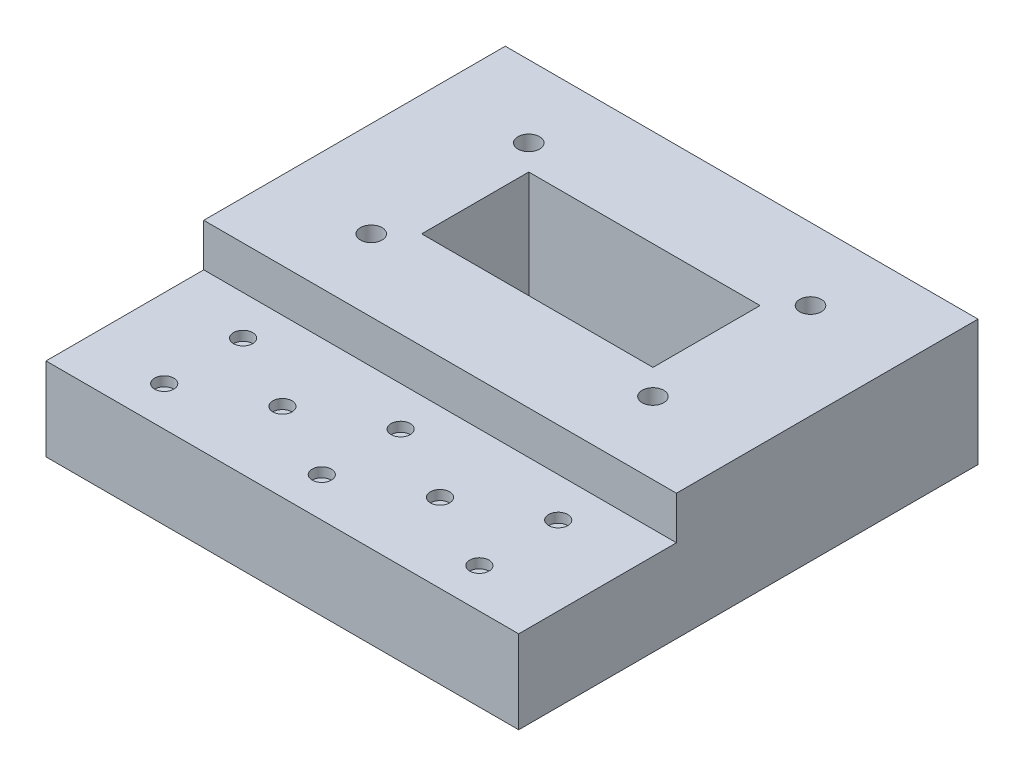
ISO-10303-21;
HEADER;
FILE_DESCRIPTION(('STEP AP214'),'2;1');
FILE_NAME('part.step','',(''),(''),'','','');
FILE_SCHEMA(('AUTOMOTIVE_DESIGN { 1 0 10303 214 1 1 1 1 }'));
ENDSEC;
DATA;
#1=APPLICATION_CONTEXT('core data for automotive mechanical design processes');
#2=APPLICATION_PROTOCOL_DEFINITION('international standard','automotive_design',2000,#1);
#3=PRODUCT_CONTEXT('',#1,'mechanical');
#4=PRODUCT('Part','Part','',(#3));
#5=PRODUCT_RELATED_PRODUCT_CATEGORY('part','',(#4));
#6=PRODUCT_DEFINITION_FORMATION('','',#4);
#7=PRODUCT_DEFINITION_CONTEXT('part definition',#1,'design');
#8=PRODUCT_DEFINITION('design','',#6,#7);
#9=PRODUCT_DEFINITION_SHAPE('','',#8);
#10=(LENGTH_UNIT() NAMED_UNIT(*) SI_UNIT(.MILLI.,.METRE.));
#11=(NAMED_UNIT(*) PLANE_ANGLE_UNIT() SI_UNIT($,.RADIAN.));
#12=(NAMED_UNIT(*) SI_UNIT($,.STERADIAN.) SOLID_ANGLE_UNIT());
#13=UNCERTAINTY_MEASURE_WITH_UNIT(LENGTH_MEASURE(1.E-05),#10,'distance_accuracy_value','');
#14=(GEOMETRIC_REPRESENTATION_CONTEXT(3) GLOBAL_UNCERTAINTY_ASSIGNED_CONTEXT((#13)) GLOBAL_UNIT_ASSIGNED_CONTEXT((#10,
#11,#12)) REPRESENTATION_CONTEXT('',''));
#15=CARTESIAN_POINT('',(0.,0.,0.));
#16=DIRECTION('',(0.,0.,1.));
#17=DIRECTION('',(1.,0.,0.));
#18=AXIS2_PLACEMENT_3D('',#15,#16,#17);
#19=CARTESIAN_POINT('',(0.,26.38,0.));
#20=DIRECTION('',(0.,1.,0.));
#21=DIRECTION('',(0.,0.,1.));
#22=AXIS2_PLACEMENT_3D('',#19,#20,#21);
#23=PLANE('',#22);
#24=CARTESIAN_POINT('',(-80.88,26.38,35.025));
#25=DIRECTION('',(0.,1.,0.));
#26=DIRECTION('',(0.,0.,1.));
#27=AXIS2_PLACEMENT_3D('',#24,#25,#26);
#28=CIRCLE('',#27,3.05);
#29=CARTESIAN_POINT('',(-80.88,26.38,38.075));
#30=VERTEX_POINT('',#29);
#31=EDGE_CURVE('E447',#30,#30,#28,.F.);
#32=ORIENTED_EDGE('',*,*,#31,.T.);
#33=EDGE_LOOP('',(#32));
#34=FACE_BOUND('',#33,.T.);
#35=CARTESIAN_POINT('',(-105.88,26.38,47.5375));
#36=DIRECTION('',(0.,1.,0.));
#37=DIRECTION('',(0.,0.,1.));
#38=AXIS2_PLACEMENT_3D('',#35,#36,#37);
#39=CIRCLE('',#38,3.04999999999999);
#40=CARTESIAN_POINT('',(-105.88,26.38,50.5875));
#41=VERTEX_POINT('',#40);
#42=EDGE_CURVE('E412',#41,#41,#39,.F.);
#43=ORIENTED_EDGE('',*,*,#42,.T.);
#44=EDGE_LOOP('',(#43));
#45=FACE_BOUND('',#44,.T.);
#46=CARTESIAN_POINT('',(-105.88,26.38,22.5125));
#47=DIRECTION('',(0.,1.,0.));
#48=DIRECTION('',(0.,0.,1.));
#49=AXIS2_PLACEMENT_3D('',#46,#47,#48);
#50=CIRCLE('',#49,3.05000000000001);
#51=CARTESIAN_POINT('',(-105.88,26.38,25.5625));
#52=VERTEX_POINT('',#51);
#53=EDGE_CURVE('E394',#52,#52,#50,.F.);
#54=ORIENTED_EDGE('',*,*,#53,.T.);
#55=EDGE_LOOP('',(#54));
#56=FACE_BOUND('',#55,.T.);
#57=DIRECTION('',(0.,0.,-1.));
#58=VECTOR('',#57,1.);
#59=CARTESIAN_POINT('',(-130.88,26.38,10.));
#60=LINE('',#59,#58);
#61=CARTESIAN_POINT('',(-130.88,26.38,60.05));
#62=VERTEX_POINT('',#61);
#63=CARTESIAN_POINT('',(-130.88,26.38,10.));
#64=VERTEX_POINT('',#63);
#65=EDGE_CURVE('E142',#62,#64,#60,.T.);
#66=ORIENTED_EDGE('',*,*,#65,.F.);
#67=DIRECTION('',(-1.,0.,0.));
#68=VECTOR('',#67,1.);
#69=CARTESIAN_POINT('',(-130.88,26.38,60.05));
#70=LINE('',#69,#68);
#71=CARTESIAN_POINT('',(19.12,26.38,60.05));
#72=VERTEX_POINT('',#71);
#73=EDGE_CURVE('E398',#72,#62,#70,.T.);
#74=ORIENTED_EDGE('',*,*,#73,.F.);
#75=DIRECTION('',(0.,0.,1.));
#76=VECTOR('',#75,1.);
#77=CARTESIAN_POINT('',(19.12,26.38,10.));
#78=LINE('',#77,#76);
#79=CARTESIAN_POINT('',(19.12,26.38,10.));
#80=VERTEX_POINT('',#79);
#81=EDGE_CURVE('E79',#80,#72,#78,.T.);
#82=ORIENTED_EDGE('',*,*,#81,.F.);
#83=DIRECTION('',(1.,0.,0.));
#84=VECTOR('',#83,1.);
#85=CARTESIAN_POINT('',(-130.88,26.38,10.));
#86=LINE('',#85,#84);
#87=EDGE_CURVE('E139',#64,#80,#86,.T.);
#88=ORIENTED_EDGE('',*,*,#87,.F.);
#89=EDGE_LOOP('',(#66,#74,#82,#88));
#90=FACE_BOUND('',#89,.T.);
#91=CARTESIAN_POINT('',(-55.88,26.38,22.5125));
#92=DIRECTION('',(0.,1.,0.));
#93=DIRECTION('',(0.,0.,1.));
#94=AXIS2_PLACEMENT_3D('',#91,#92,#93);
#95=CIRCLE('',#94,3.05);
#96=CARTESIAN_POINT('',(-55.88,26.38,25.5625));
#97=VERTEX_POINT('',#96);
#98=EDGE_CURVE('E441',#97,#97,#95,.T.);
#99=ORIENTED_EDGE('',*,*,#98,.F.);
#100=EDGE_LOOP('',(#99));
#101=FACE_BOUND('',#100,.T.);
#102=CARTESIAN_POINT('',(-55.88,26.38,47.5375));
#103=DIRECTION('',(0.,1.,0.));
#104=DIRECTION('',(0.,0.,1.));
#105=AXIS2_PLACEMENT_3D('',#102,#103,#104);
#106=CIRCLE('',#105,3.05);
#107=CARTESIAN_POINT('',(-55.88,26.38,50.5875));
#108=VERTEX_POINT('',#107);
#109=EDGE_CURVE('E435',#108,#108,#106,.T.);
#110=ORIENTED_EDGE('',*,*,#109,.F.);
#111=EDGE_LOOP('',(#110));
#112=FACE_BOUND('',#111,.T.);
#113=CARTESIAN_POINT('',(-30.88,26.38,35.025));
#114=DIRECTION('',(0.,1.,0.));
#115=DIRECTION('',(0.,0.,1.));
#116=AXIS2_PLACEMENT_3D('',#113,#114,#115);
#117=CIRCLE('',#116,3.05);
#118=CARTESIAN_POINT('',(-30.88,26.38,38.075));
#119=VERTEX_POINT('',#118);
#120=EDGE_CURVE('E429',#119,#119,#117,.T.);
#121=ORIENTED_EDGE('',*,*,#120,.F.);
#122=EDGE_LOOP('',(#121));
#123=FACE_BOUND('',#122,.T.);
#124=CARTESIAN_POINT('',(-5.88,26.38,22.5125));
#125=DIRECTION('',(0.,1.,0.));
#126=DIRECTION('',(0.,0.,1.));
#127=AXIS2_PLACEMENT_3D('',#124,#125,#126);
#128=CIRCLE('',#127,3.05);
#129=CARTESIAN_POINT('',(-5.88,26.38,25.5625));
#130=VERTEX_POINT('',#129);
#131=EDGE_CURVE('E423',#130,#130,#128,.T.);
#132=ORIENTED_EDGE('',*,*,#131,.F.);
#133=EDGE_LOOP('',(#132));
#134=FACE_BOUND('',#133,.T.);
#135=CARTESIAN_POINT('',(-5.88,26.38,47.5375));
#136=DIRECTION('',(0.,1.,0.));
#137=DIRECTION('',(0.,0.,1.));
#138=AXIS2_PLACEMENT_3D('',#135,#136,#137);
#139=CIRCLE('',#138,3.05);
#140=CARTESIAN_POINT('',(-5.88,26.38,50.5875));
#141=VERTEX_POINT('',#140);
#142=EDGE_CURVE('E417',#141,#141,#139,.T.);
#143=ORIENTED_EDGE('',*,*,#142,.F.);
#144=EDGE_LOOP('',(#143));
#145=FACE_BOUND('',#144,.T.);
#146=ADVANCED_FACE('F62',(#34,#45,#56,#90,#101,#112,#123,#134,#145),#23,.T.);
#147=CARTESIAN_POINT('',(-100.58,40.,-12.85));
#148=DIRECTION('',(0.,-1.,0.));
#149=DIRECTION('',(0.,0.,-1.));
#150=AXIS2_PLACEMENT_3D('',#147,#148,#149);
#151=CYLINDRICAL_SURFACE('',#150,3.43);
#152=CARTESIAN_POINT('',(-100.58,40.,-12.85));
#153=DIRECTION('',(0.,1.,0.));
#154=DIRECTION('',(0.,0.,1.));
#155=AXIS2_PLACEMENT_3D('',#152,#153,#154);
#156=CIRCLE('',#155,3.43);
#157=CARTESIAN_POINT('',(-100.58,40.,-9.41999999999997));
#158=VERTEX_POINT('',#157);
#159=EDGE_CURVE('E203',#158,#158,#156,.T.);
#160=ORIENTED_EDGE('',*,*,#159,.T.);
#161=EDGE_LOOP('',(#160));
#162=FACE_BOUND('',#161,.T.);
#163=CARTESIAN_POINT('',(-100.58,8.,-12.85));
#164=DIRECTION('',(0.,-1.,0.));
#165=DIRECTION('',(0.,0.,-1.));
#166=AXIS2_PLACEMENT_3D('',#163,#164,#165);
#167=CIRCLE('',#166,3.43);
#168=CARTESIAN_POINT('',(-100.58,8.,-16.28));
#169=VERTEX_POINT('',#168);
#170=EDGE_CURVE('E66',#169,#169,#167,.T.);
#171=ORIENTED_EDGE('',*,*,#170,.T.);
#172=EDGE_LOOP('',(#171));
#173=FACE_BOUND('',#172,.T.);
#174=ADVANCED_FACE('F249',(#162,#173),#151,.F.);
#175=CARTESIAN_POINT('',(-100.58,40.,-62.84));
#176=DIRECTION('',(0.,-1.,0.));
#177=DIRECTION('',(0.,0.,-1.));
#178=AXIS2_PLACEMENT_3D('',#175,#176,#177);
#179=CYLINDRICAL_SURFACE('',#178,3.43);
#180=CARTESIAN_POINT('',(-100.58,40.,-62.84));
#181=DIRECTION('',(0.,1.,0.));
#182=DIRECTION('',(0.,0.,1.));
#183=AXIS2_PLACEMENT_3D('',#180,#181,#182);
#184=CIRCLE('',#183,3.43);
#185=CARTESIAN_POINT('',(-100.58,40.,-59.41));
#186=VERTEX_POINT('',#185);
#187=EDGE_CURVE('E200',#186,#186,#184,.T.);
#188=ORIENTED_EDGE('',*,*,#187,.T.);
#189=EDGE_LOOP('',(#188));
#190=FACE_BOUND('',#189,.T.);
#191=CARTESIAN_POINT('',(-100.58,8.,-62.84));
#192=DIRECTION('',(0.,-1.,0.));
#193=DIRECTION('',(0.,0.,-1.));
#194=AXIS2_PLACEMENT_3D('',#191,#192,#193);
#195=CIRCLE('',#194,3.43);
#196=CARTESIAN_POINT('',(-100.58,8.,-66.27));
#197=VERTEX_POINT('',#196);
#198=EDGE_CURVE('E242',#197,#197,#195,.T.);
#199=ORIENTED_EDGE('',*,*,#198,.T.);
#200=EDGE_LOOP('',(#199));
#201=FACE_BOUND('',#200,.T.);
#202=ADVANCED_FACE('F307',(#190,#201),#179,.F.);
#203=CARTESIAN_POINT('',(-11.1800000000001,40.,-62.84));
#204=DIRECTION('',(0.,-1.,0.));
#205=DIRECTION('',(0.,0.,-1.));
#206=AXIS2_PLACEMENT_3D('',#203,#204,#205);
#207=CYLINDRICAL_SURFACE('',#206,3.43);
#208=CARTESIAN_POINT('',(-11.1800000000001,40.,-62.84));
#209=DIRECTION('',(0.,1.,0.));
#210=DIRECTION('',(0.,0.,1.));
#211=AXIS2_PLACEMENT_3D('',#208,#209,#210);
#212=CIRCLE('',#211,3.43);
#213=CARTESIAN_POINT('',(-11.1800000000001,40.,-59.41));
#214=VERTEX_POINT('',#213);
#215=EDGE_CURVE('E197',#214,#214,#212,.T.);
#216=ORIENTED_EDGE('',*,*,#215,.T.);
#217=EDGE_LOOP('',(#216));
#218=FACE_BOUND('',#217,.T.);
#219=CARTESIAN_POINT('',(-11.1800000000001,8.,-62.84));
#220=DIRECTION('',(0.,-1.,0.));
#221=DIRECTION('',(0.,0.,-1.));
#222=AXIS2_PLACEMENT_3D('',#219,#220,#221);
#223=CIRCLE('',#222,3.43);
#224=CARTESIAN_POINT('',(-11.1800000000001,8.,-66.27));
#225=VERTEX_POINT('',#224);
#226=EDGE_CURVE('E240',#225,#225,#223,.T.);
#227=ORIENTED_EDGE('',*,*,#226,.T.);
#228=EDGE_LOOP('',(#227));
#229=FACE_BOUND('',#228,.T.);
#230=ADVANCED_FACE('F351',(#218,#229),#207,.F.);
#231=CARTESIAN_POINT('',(-11.18,40.,-12.85));
#232=DIRECTION('',(0.,-1.,0.));
#233=DIRECTION('',(0.,0.,-1.));
#234=AXIS2_PLACEMENT_3D('',#231,#232,#233);
#235=CYLINDRICAL_SURFACE('',#234,3.43);
#236=CARTESIAN_POINT('',(-11.18,40.,-12.85));
#237=DIRECTION('',(0.,1.,0.));
#238=DIRECTION('',(0.,0.,1.));
#239=AXIS2_PLACEMENT_3D('',#236,#237,#238);
#240=CIRCLE('',#239,3.43);
#241=CARTESIAN_POINT('',(-11.18,40.,-9.41999999999998));
#242=VERTEX_POINT('',#241);
#243=EDGE_CURVE('E194',#242,#242,#240,.T.);
#244=ORIENTED_EDGE('',*,*,#243,.T.);
#245=EDGE_LOOP('',(#244));
#246=FACE_BOUND('',#245,.T.);
#247=CARTESIAN_POINT('',(-11.18,8.,-12.85));
#248=DIRECTION('',(0.,-1.,0.));
#249=DIRECTION('',(0.,0.,-1.));
#250=AXIS2_PLACEMENT_3D('',#247,#248,#249);
#251=CIRCLE('',#250,3.43);
#252=CARTESIAN_POINT('',(-11.18,8.,-16.28));
#253=VERTEX_POINT('',#252);
#254=EDGE_CURVE('E191',#253,#253,#251,.T.);
#255=ORIENTED_EDGE('',*,*,#254,.T.);
#256=EDGE_LOOP('',(#255));
#257=FACE_BOUND('',#256,.T.);
#258=ADVANCED_FACE('F348',(#246,#257),#235,.F.);
#259=CARTESIAN_POINT('',(0.,40.,0.));
#260=DIRECTION('',(0.,1.,0.));
#261=DIRECTION('',(0.,0.,1.));
#262=AXIS2_PLACEMENT_3D('',#259,#260,#261);
#263=PLANE('',#262);
#264=ORIENTED_EDGE('',*,*,#215,.F.);
#265=EDGE_LOOP('',(#264));
#266=FACE_BOUND('',#265,.T.);
#267=ORIENTED_EDGE('',*,*,#159,.F.);
#268=EDGE_LOOP('',(#267));
#269=FACE_BOUND('',#268,.T.);
#270=DIRECTION('',(-1.,0.,0.));
#271=VECTOR('',#270,1.);
#272=CARTESIAN_POINT('',(-121.76,40.,-85.69));
#273=LINE('',#272,#271);
#274=CARTESIAN_POINT('',(19.12,40.,-85.69));
#275=VERTEX_POINT('',#274);
#276=CARTESIAN_POINT('',(-130.88,40.,-85.69));
#277=VERTEX_POINT('',#276);
#278=EDGE_CURVE('E12',#275,#277,#273,.T.);
#279=ORIENTED_EDGE('',*,*,#278,.T.);
#280=DIRECTION('',(0.,0.,1.));
#281=VECTOR('',#280,1.);
#282=CARTESIAN_POINT('',(-130.88,40.,0.));
#283=LINE('',#282,#281);
#284=CARTESIAN_POINT('',(-130.88,40.,10.));
#285=VERTEX_POINT('',#284);
#286=EDGE_CURVE('E159',#277,#285,#283,.T.);
#287=ORIENTED_EDGE('',*,*,#286,.T.);
#288=DIRECTION('',(1.,0.,0.));
#289=VECTOR('',#288,1.);
#290=CARTESIAN_POINT('',(-121.76,40.,10.));
#291=LINE('',#290,#289);
#292=CARTESIAN_POINT('',(19.12,40.,10.));
#293=VERTEX_POINT('',#292);
#294=EDGE_CURVE('E71',#285,#293,#291,.T.);
#295=ORIENTED_EDGE('',*,*,#294,.T.);
#296=DIRECTION('',(0.,0.,-1.));
#297=VECTOR('',#296,1.);
#298=CARTESIAN_POINT('',(19.12,40.,0.));
#299=LINE('',#298,#297);
#300=EDGE_CURVE('E169',#293,#275,#299,.T.);
#301=ORIENTED_EDGE('',*,*,#300,.T.);
#302=EDGE_LOOP('',(#279,#287,#295,#301));
#303=FACE_BOUND('',#302,.T.);
#304=DIRECTION('',(1.,0.,0.));
#305=VECTOR('',#304,1.);
#306=CARTESIAN_POINT('',(-92.58,40.,-20.85));
#307=LINE('',#306,#305);
#308=CARTESIAN_POINT('',(-92.58,40.,-20.85));
#309=VERTEX_POINT('',#308);
#310=CARTESIAN_POINT('',(-19.18,40.,-20.85));
#311=VERTEX_POINT('',#310);
#312=EDGE_CURVE('E209',#309,#311,#307,.T.);
#313=ORIENTED_EDGE('',*,*,#312,.F.);
#314=DIRECTION('',(0.,0.,1.));
#315=VECTOR('',#314,1.);
#316=CARTESIAN_POINT('',(-92.58,40.,-20.85));
#317=LINE('',#316,#315);
#318=CARTESIAN_POINT('',(-92.58,40.,-54.84));
#319=VERTEX_POINT('',#318);
#320=EDGE_CURVE('E207',#319,#309,#317,.T.);
#321=ORIENTED_EDGE('',*,*,#320,.F.);
#322=DIRECTION('',(-1.,0.,0.));
#323=VECTOR('',#322,1.);
#324=CARTESIAN_POINT('',(-92.58,40.,-54.84));
#325=LINE('',#324,#323);
#326=CARTESIAN_POINT('',(-19.18,40.,-54.84));
#327=VERTEX_POINT('',#326);
#328=EDGE_CURVE('E214',#327,#319,#325,.T.);
#329=ORIENTED_EDGE('',*,*,#328,.F.);
#330=DIRECTION('',(0.,0.,-1.));
#331=VECTOR('',#330,1.);
#332=CARTESIAN_POINT('',(-19.18,40.,-20.85));
#333=LINE('',#332,#331);
#334=EDGE_CURVE('E212',#311,#327,#333,.T.);
#335=ORIENTED_EDGE('',*,*,#334,.F.);
#336=EDGE_LOOP('',(#313,#321,#329,#335));
#337=FACE_BOUND('',#336,.T.);
#338=ORIENTED_EDGE('',*,*,#187,.F.);
#339=EDGE_LOOP('',(#338));
#340=FACE_BOUND('',#339,.T.);
#341=ORIENTED_EDGE('',*,*,#243,.F.);
#342=EDGE_LOOP('',(#341));
#343=FACE_BOUND('',#342,.T.);
#344=ADVANCED_FACE('F267',(#266,#269,#303,#337,#340,#343),#263,.T.);
#345=CARTESIAN_POINT('',(0.,0.,0.));
#346=DIRECTION('',(0.,1.,0.));
#347=DIRECTION('',(0.,0.,1.));
#348=AXIS2_PLACEMENT_3D('',#345,#346,#347);
#349=PLANE('',#348);
#350=CARTESIAN_POINT('',(-100.58,0.,-62.84));
#351=DIRECTION('',(0.,-1.,0.));
#352=DIRECTION('',(0.,0.,-1.));
#353=AXIS2_PLACEMENT_3D('',#350,#351,#352);
#354=CIRCLE('',#353,8.00000000000006);
#355=CARTESIAN_POINT('',(-100.58,0.,-70.8400000000001));
#356=VERTEX_POINT('',#355);
#357=EDGE_CURVE('E162',#356,#356,#354,.T.);
#358=ORIENTED_EDGE('',*,*,#357,.F.);
#359=EDGE_LOOP('',(#358));
#360=FACE_BOUND('',#359,.T.);
#361=CARTESIAN_POINT('',(-11.1800000000001,0.,-62.84));
#362=DIRECTION('',(0.,-1.,0.));
#363=DIRECTION('',(0.,0.,-1.));
#364=AXIS2_PLACEMENT_3D('',#361,#362,#363);
#365=CIRCLE('',#364,7.99999999999995);
#366=CARTESIAN_POINT('',(-11.1800000000001,0.,-70.84));
#367=VERTEX_POINT('',#366);
#368=EDGE_CURVE('E180',#367,#367,#365,.T.);
#369=ORIENTED_EDGE('',*,*,#368,.F.);
#370=EDGE_LOOP('',(#369));
#371=FACE_BOUND('',#370,.T.);
#372=CARTESIAN_POINT('',(-11.18,0.,-12.85));
#373=DIRECTION('',(0.,-1.,0.));
#374=DIRECTION('',(0.,0.,-1.));
#375=AXIS2_PLACEMENT_3D('',#372,#373,#374);
#376=CIRCLE('',#375,8.00000000000002);
#377=CARTESIAN_POINT('',(-11.18,0.,-20.85));
#378=VERTEX_POINT('',#377);
#379=EDGE_CURVE('E174',#378,#378,#376,.T.);
#380=ORIENTED_EDGE('',*,*,#379,.F.);
#381=EDGE_LOOP('',(#380));
#382=FACE_BOUND('',#381,.T.);
#383=CARTESIAN_POINT('',(-100.58,0.,-12.85));
#384=DIRECTION('',(0.,-1.,0.));
#385=DIRECTION('',(0.,0.,-1.));
#386=AXIS2_PLACEMENT_3D('',#383,#384,#385);
#387=CIRCLE('',#386,8.00000000000001);
#388=CARTESIAN_POINT('',(-100.58,0.,-20.85));
#389=VERTEX_POINT('',#388);
#390=EDGE_CURVE('E173',#389,#389,#387,.T.);
#391=ORIENTED_EDGE('',*,*,#390,.F.);
#392=EDGE_LOOP('',(#391));
#393=FACE_BOUND('',#392,.T.);
#394=DIRECTION('',(0.,0.,-1.));
#395=VECTOR('',#394,1.);
#396=CARTESIAN_POINT('',(19.12,0.,0.));
#397=LINE('',#396,#395);
#398=CARTESIAN_POINT('',(19.12,0.,60.05));
#399=VERTEX_POINT('',#398);
#400=CARTESIAN_POINT('',(19.12,0.,-85.69));
#401=VERTEX_POINT('',#400);
#402=EDGE_CURVE('E273',#399,#401,#397,.T.);
#403=ORIENTED_EDGE('',*,*,#402,.F.);
#404=DIRECTION('',(-1.,0.,0.));
#405=VECTOR('',#404,1.);
#406=CARTESIAN_POINT('',(-130.88,0.,60.05));
#407=LINE('',#406,#405);
#408=CARTESIAN_POINT('',(-130.88,0.,60.05));
#409=VERTEX_POINT('',#408);
#410=EDGE_CURVE('E157',#399,#409,#407,.T.);
#411=ORIENTED_EDGE('',*,*,#410,.T.);
#412=DIRECTION('',(0.,0.,1.));
#413=VECTOR('',#412,1.);
#414=CARTESIAN_POINT('',(-130.88,0.,0.));
#415=LINE('',#414,#413);
#416=CARTESIAN_POINT('',(-130.88,0.,-85.69));
#417=VERTEX_POINT('',#416);
#418=EDGE_CURVE('E160',#417,#409,#415,.T.);
#419=ORIENTED_EDGE('',*,*,#418,.F.);
#420=DIRECTION('',(-1.,0.,0.));
#421=VECTOR('',#420,1.);
#422=CARTESIAN_POINT('',(-121.76,0.,-85.69));
#423=LINE('',#422,#421);
#424=EDGE_CURVE('E235',#401,#417,#423,.T.);
#425=ORIENTED_EDGE('',*,*,#424,.F.);
#426=EDGE_LOOP('',(#403,#411,#419,#425));
#427=FACE_BOUND('',#426,.T.);
#428=DIRECTION('',(0.,0.,1.));
#429=VECTOR('',#428,1.);
#430=CARTESIAN_POINT('',(-92.58,0.,-20.85));
#431=LINE('',#430,#429);
#432=CARTESIAN_POINT('',(-92.58,0.,-54.84));
#433=VERTEX_POINT('',#432);
#434=CARTESIAN_POINT('',(-92.58,0.,-20.85));
#435=VERTEX_POINT('',#434);
#436=EDGE_CURVE('E206',#433,#435,#431,.T.);
#437=ORIENTED_EDGE('',*,*,#436,.T.);
#438=DIRECTION('',(1.,0.,0.));
#439=VECTOR('',#438,1.);
#440=CARTESIAN_POINT('',(-92.58,0.,-20.85));
#441=LINE('',#440,#439);
#442=CARTESIAN_POINT('',(-19.18,0.,-20.85));
#443=VERTEX_POINT('',#442);
#444=EDGE_CURVE('E219',#435,#443,#441,.T.);
#445=ORIENTED_EDGE('',*,*,#444,.T.);
#446=DIRECTION('',(0.,0.,-1.));
#447=VECTOR('',#446,1.);
#448=CARTESIAN_POINT('',(-19.18,0.,-20.85));
#449=LINE('',#448,#447);
#450=CARTESIAN_POINT('',(-19.18,0.,-54.84));
#451=VERTEX_POINT('',#450);
#452=EDGE_CURVE('E222',#443,#451,#449,.T.);
#453=ORIENTED_EDGE('',*,*,#452,.T.);
#454=DIRECTION('',(-1.,0.,0.));
#455=VECTOR('',#454,1.);
#456=CARTESIAN_POINT('',(-92.58,0.,-54.84));
#457=LINE('',#456,#455);
#458=EDGE_CURVE('E210',#451,#433,#457,.T.);
#459=ORIENTED_EDGE('',*,*,#458,.T.);
#460=EDGE_LOOP('',(#437,#445,#453,#459));
#461=FACE_BOUND('',#460,.T.);
#462=ADVANCED_FACE('F264',(#360,#371,#382,#393,#427,#461),#349,.F.);
#463=CARTESIAN_POINT('',(-121.76,40.,10.));
#464=DIRECTION('',(0.,0.,-1.));
#465=DIRECTION('',(-1.,0.,0.));
#466=AXIS2_PLACEMENT_3D('',#463,#464,#465);
#467=PLANE('',#466);
#468=DIRECTION('',(0.,-1.,0.));
#469=VECTOR('',#468,1.);
#470=CARTESIAN_POINT('',(-130.88,136.123620926388,10.));
#471=LINE('',#470,#469);
#472=EDGE_CURVE('E153',#285,#64,#471,.T.);
#473=ORIENTED_EDGE('',*,*,#472,.T.);
#474=ORIENTED_EDGE('',*,*,#87,.T.);
#475=DIRECTION('',(0.,-1.,0.));
#476=VECTOR('',#475,1.);
#477=CARTESIAN_POINT('',(19.12,136.123620926388,10.));
#478=LINE('',#477,#476);
#479=EDGE_CURVE('E404',#293,#80,#478,.T.);
#480=ORIENTED_EDGE('',*,*,#479,.F.);
#481=ORIENTED_EDGE('',*,*,#294,.F.);
#482=EDGE_LOOP('',(#473,#474,#480,#481));
#483=FACE_BOUND('',#482,.T.);
#484=ADVANCED_FACE('F64',(#483),#467,.F.);
#485=CARTESIAN_POINT('',(-121.76,40.,-85.69));
#486=DIRECTION('',(0.,0.,1.));
#487=DIRECTION('',(1.,0.,0.));
#488=AXIS2_PLACEMENT_3D('',#485,#486,#487);
#489=PLANE('',#488);
#490=ORIENTED_EDGE('',*,*,#424,.T.);
#491=DIRECTION('',(0.,-1.,0.));
#492=VECTOR('',#491,1.);
#493=CARTESIAN_POINT('',(-130.88,136.123620926388,-85.69));
#494=LINE('',#493,#492);
#495=EDGE_CURVE('E164',#277,#417,#494,.T.);
#496=ORIENTED_EDGE('',*,*,#495,.F.);
#497=ORIENTED_EDGE('',*,*,#278,.F.);
#498=DIRECTION('',(0.,-1.,0.));
#499=VECTOR('',#498,1.);
#500=CARTESIAN_POINT('',(19.12,136.123620926388,-85.69));
#501=LINE('',#500,#499);
#502=EDGE_CURVE('E388',#275,#401,#501,.T.);
#503=ORIENTED_EDGE('',*,*,#502,.T.);
#504=EDGE_LOOP('',(#490,#496,#497,#503));
#505=FACE_BOUND('',#504,.T.);
#506=ADVANCED_FACE('F378',(#505),#489,.F.);
#507=CARTESIAN_POINT('',(-92.58,40.,-20.85));
#508=DIRECTION('',(1.,0.,0.));
#509=DIRECTION('',(0.,0.,-1.));
#510=AXIS2_PLACEMENT_3D('',#507,#508,#509);
#511=PLANE('',#510);
#512=ORIENTED_EDGE('',*,*,#436,.F.);
#513=DIRECTION('',(0.,-1.,0.));
#514=VECTOR('',#513,1.);
#515=CARTESIAN_POINT('',(-92.58,40.,-54.84));
#516=LINE('',#515,#514);
#517=EDGE_CURVE('E216',#319,#433,#516,.T.);
#518=ORIENTED_EDGE('',*,*,#517,.F.);
#519=ORIENTED_EDGE('',*,*,#320,.T.);
#520=DIRECTION('',(0.,-1.,0.));
#521=VECTOR('',#520,1.);
#522=CARTESIAN_POINT('',(-92.58,40.,-20.85));
#523=LINE('',#522,#521);
#524=EDGE_CURVE('E232',#309,#435,#523,.T.);
#525=ORIENTED_EDGE('',*,*,#524,.T.);
#526=EDGE_LOOP('',(#512,#518,#519,#525));
#527=FACE_BOUND('',#526,.T.);
#528=ADVANCED_FACE('F277',(#527),#511,.T.);
#529=CARTESIAN_POINT('',(-92.58,40.,-20.85));
#530=DIRECTION('',(0.,0.,-1.));
#531=DIRECTION('',(-1.,0.,0.));
#532=AXIS2_PLACEMENT_3D('',#529,#530,#531);
#533=PLANE('',#532);
#534=ORIENTED_EDGE('',*,*,#444,.F.);
#535=ORIENTED_EDGE('',*,*,#524,.F.);
#536=ORIENTED_EDGE('',*,*,#312,.T.);
#537=DIRECTION('',(0.,-1.,0.));
#538=VECTOR('',#537,1.);
#539=CARTESIAN_POINT('',(-19.18,40.,-20.85));
#540=LINE('',#539,#538);
#541=EDGE_CURVE('E230',#311,#443,#540,.T.);
#542=ORIENTED_EDGE('',*,*,#541,.T.);
#543=EDGE_LOOP('',(#534,#535,#536,#542));
#544=FACE_BOUND('',#543,.T.);
#545=ADVANCED_FACE('F287',(#544),#533,.T.);
#546=CARTESIAN_POINT('',(-19.18,40.,-20.85));
#547=DIRECTION('',(-1.,0.,0.));
#548=DIRECTION('',(0.,0.,1.));
#549=AXIS2_PLACEMENT_3D('',#546,#547,#548);
#550=PLANE('',#549);
#551=ORIENTED_EDGE('',*,*,#452,.F.);
#552=ORIENTED_EDGE('',*,*,#541,.F.);
#553=ORIENTED_EDGE('',*,*,#334,.T.);
#554=DIRECTION('',(0.,-1.,0.));
#555=VECTOR('',#554,1.);
#556=CARTESIAN_POINT('',(-19.18,40.,-54.84));
#557=LINE('',#556,#555);
#558=EDGE_CURVE('E87',#327,#451,#557,.T.);
#559=ORIENTED_EDGE('',*,*,#558,.T.);
#560=EDGE_LOOP('',(#551,#552,#553,#559));
#561=FACE_BOUND('',#560,.T.);
#562=ADVANCED_FACE('F291',(#561),#550,.T.);
#563=CARTESIAN_POINT('',(-92.58,40.,-54.84));
#564=DIRECTION('',(0.,0.,1.));
#565=DIRECTION('',(1.,0.,0.));
#566=AXIS2_PLACEMENT_3D('',#563,#564,#565);
#567=PLANE('',#566);
#568=ORIENTED_EDGE('',*,*,#458,.F.);
#569=ORIENTED_EDGE('',*,*,#558,.F.);
#570=ORIENTED_EDGE('',*,*,#328,.T.);
#571=ORIENTED_EDGE('',*,*,#517,.T.);
#572=EDGE_LOOP('',(#568,#569,#570,#571));
#573=FACE_BOUND('',#572,.T.);
#574=ADVANCED_FACE('F280',(#573),#567,.T.);
#575=CARTESIAN_POINT('',(-11.18,8.,-12.85));
#576=DIRECTION('',(0.,-1.,0.));
#577=DIRECTION('',(0.,0.,-1.));
#578=AXIS2_PLACEMENT_3D('',#575,#576,#577);
#579=CYLINDRICAL_SURFACE('',#578,8.00000000000002);
#580=CARTESIAN_POINT('',(-11.18,8.,-12.85));
#581=DIRECTION('',(0.,-1.,0.));
#582=DIRECTION('',(0.,0.,-1.));
#583=AXIS2_PLACEMENT_3D('',#580,#581,#582);
#584=CIRCLE('',#583,8.00000000000002);
#585=CARTESIAN_POINT('',(-11.18,8.,-20.85));
#586=VERTEX_POINT('',#585);
#587=EDGE_CURVE('E170',#586,#586,#584,.T.);
#588=ORIENTED_EDGE('',*,*,#587,.F.);
#589=EDGE_LOOP('',(#588));
#590=FACE_BOUND('',#589,.T.);
#591=ORIENTED_EDGE('',*,*,#379,.T.);
#592=EDGE_LOOP('',(#591));
#593=FACE_BOUND('',#592,.T.);
#594=ADVANCED_FACE('F298',(#590,#593),#579,.F.);
#595=CARTESIAN_POINT('',(-11.18,8.,-12.85));
#596=DIRECTION('',(0.,-1.,0.));
#597=DIRECTION('',(0.,0.,-1.));
#598=AXIS2_PLACEMENT_3D('',#595,#596,#597);
#599=PLANE('',#598);
#600=ORIENTED_EDGE('',*,*,#254,.F.);
#601=EDGE_LOOP('',(#600));
#602=FACE_BOUND('',#601,.T.);
#603=ORIENTED_EDGE('',*,*,#587,.T.);
#604=EDGE_LOOP('',(#603));
#605=FACE_BOUND('',#604,.T.);
#606=ADVANCED_FACE('F326',(#602,#605),#599,.T.);
#607=CARTESIAN_POINT('',(-11.1800000000001,8.,-62.84));
#608=DIRECTION('',(0.,-1.,0.));
#609=DIRECTION('',(0.,0.,-1.));
#610=AXIS2_PLACEMENT_3D('',#607,#608,#609);
#611=CYLINDRICAL_SURFACE('',#610,7.99999999999995);
#612=CARTESIAN_POINT('',(-11.1800000000001,8.,-62.84));
#613=DIRECTION('',(0.,-1.,0.));
#614=DIRECTION('',(0.,0.,-1.));
#615=AXIS2_PLACEMENT_3D('',#612,#613,#614);
#616=CIRCLE('',#615,7.99999999999995);
#617=CARTESIAN_POINT('',(-11.1800000000001,8.,-70.84));
#618=VERTEX_POINT('',#617);
#619=EDGE_CURVE('E177',#618,#618,#616,.T.);
#620=ORIENTED_EDGE('',*,*,#619,.F.);
#621=EDGE_LOOP('',(#620));
#622=FACE_BOUND('',#621,.T.);
#623=ORIENTED_EDGE('',*,*,#368,.T.);
#624=EDGE_LOOP('',(#623));
#625=FACE_BOUND('',#624,.T.);
#626=ADVANCED_FACE('F329',(#622,#625),#611,.F.);
#627=CARTESIAN_POINT('',(-11.1800000000001,8.,-62.84));
#628=DIRECTION('',(0.,-1.,0.));
#629=DIRECTION('',(0.,0.,-1.));
#630=AXIS2_PLACEMENT_3D('',#627,#628,#629);
#631=PLANE('',#630);
#632=ORIENTED_EDGE('',*,*,#226,.F.);
#633=EDGE_LOOP('',(#632));
#634=FACE_BOUND('',#633,.T.);
#635=ORIENTED_EDGE('',*,*,#619,.T.);
#636=EDGE_LOOP('',(#635));
#637=FACE_BOUND('',#636,.T.);
#638=ADVANCED_FACE('F334',(#634,#637),#631,.T.);
#639=CARTESIAN_POINT('',(-100.58,8.,-62.84));
#640=DIRECTION('',(0.,-1.,0.));
#641=DIRECTION('',(0.,0.,-1.));
#642=AXIS2_PLACEMENT_3D('',#639,#640,#641);
#643=CYLINDRICAL_SURFACE('',#642,8.00000000000006);
#644=CARTESIAN_POINT('',(-100.58,8.,-62.84));
#645=DIRECTION('',(0.,-1.,0.));
#646=DIRECTION('',(0.,0.,-1.));
#647=AXIS2_PLACEMENT_3D('',#644,#645,#646);
#648=CIRCLE('',#647,8.00000000000006);
#649=CARTESIAN_POINT('',(-100.58,8.,-70.8400000000001));
#650=VERTEX_POINT('',#649);
#651=EDGE_CURVE('E183',#650,#650,#648,.T.);
#652=ORIENTED_EDGE('',*,*,#651,.F.);
#653=EDGE_LOOP('',(#652));
#654=FACE_BOUND('',#653,.T.);
#655=ORIENTED_EDGE('',*,*,#357,.T.);
#656=EDGE_LOOP('',(#655));
#657=FACE_BOUND('',#656,.T.);
#658=ADVANCED_FACE('F337',(#654,#657),#643,.F.);
#659=CARTESIAN_POINT('',(-100.58,8.,-62.84));
#660=DIRECTION('',(0.,-1.,0.));
#661=DIRECTION('',(0.,0.,-1.));
#662=AXIS2_PLACEMENT_3D('',#659,#660,#661);
#663=PLANE('',#662);
#664=ORIENTED_EDGE('',*,*,#198,.F.);
#665=EDGE_LOOP('',(#664));
#666=FACE_BOUND('',#665,.T.);
#667=ORIENTED_EDGE('',*,*,#651,.T.);
#668=EDGE_LOOP('',(#667));
#669=FACE_BOUND('',#668,.T.);
#670=ADVANCED_FACE('F260',(#666,#669),#663,.T.);
#671=CARTESIAN_POINT('',(-100.58,8.,-12.85));
#672=DIRECTION('',(0.,-1.,0.));
#673=DIRECTION('',(0.,0.,-1.));
#674=AXIS2_PLACEMENT_3D('',#671,#672,#673);
#675=CYLINDRICAL_SURFACE('',#674,8.00000000000001);
#676=CARTESIAN_POINT('',(-100.58,8.,-12.85));
#677=DIRECTION('',(0.,-1.,0.));
#678=DIRECTION('',(0.,0.,-1.));
#679=AXIS2_PLACEMENT_3D('',#676,#677,#678);
#680=CIRCLE('',#679,8.00000000000001);
#681=CARTESIAN_POINT('',(-100.58,8.,-20.85));
#682=VERTEX_POINT('',#681);
#683=EDGE_CURVE('E188',#682,#682,#680,.T.);
#684=ORIENTED_EDGE('',*,*,#683,.F.);
#685=EDGE_LOOP('',(#684));
#686=FACE_BOUND('',#685,.T.);
#687=ORIENTED_EDGE('',*,*,#390,.T.);
#688=EDGE_LOOP('',(#687));
#689=FACE_BOUND('',#688,.T.);
#690=ADVANCED_FACE('F254',(#686,#689),#675,.F.);
#691=CARTESIAN_POINT('',(-100.58,8.,-12.85));
#692=DIRECTION('',(0.,-1.,0.));
#693=DIRECTION('',(0.,0.,-1.));
#694=AXIS2_PLACEMENT_3D('',#691,#692,#693);
#695=PLANE('',#694);
#696=ORIENTED_EDGE('',*,*,#170,.F.);
#697=EDGE_LOOP('',(#696));
#698=FACE_BOUND('',#697,.T.);
#699=ORIENTED_EDGE('',*,*,#683,.T.);
#700=EDGE_LOOP('',(#699));
#701=FACE_BOUND('',#700,.T.);
#702=ADVANCED_FACE('F251',(#698,#701),#695,.T.);
#703=CARTESIAN_POINT('',(-130.88,136.123620926388,0.));
#704=DIRECTION('',(1.,0.,0.));
#705=DIRECTION('',(0.,0.,-1.));
#706=AXIS2_PLACEMENT_3D('',#703,#704,#705);
#707=PLANE('',#706);
#708=ORIENTED_EDGE('',*,*,#286,.F.);
#709=ORIENTED_EDGE('',*,*,#495,.T.);
#710=ORIENTED_EDGE('',*,*,#418,.T.);
#711=DIRECTION('',(0.,-1.,0.));
#712=VECTOR('',#711,1.);
#713=CARTESIAN_POINT('',(-130.88,26.38,60.05));
#714=LINE('',#713,#712);
#715=EDGE_CURVE('E156',#62,#409,#714,.T.);
#716=ORIENTED_EDGE('',*,*,#715,.F.);
#717=ORIENTED_EDGE('',*,*,#65,.T.);
#718=ORIENTED_EDGE('',*,*,#472,.F.);
#719=EDGE_LOOP('',(#708,#709,#710,#716,#717,#718));
#720=FACE_BOUND('',#719,.T.);
#721=ADVANCED_FACE('F152',(#720),#707,.F.);
#722=CARTESIAN_POINT('',(19.12,136.123620926388,0.));
#723=DIRECTION('',(-1.,0.,0.));
#724=DIRECTION('',(0.,0.,1.));
#725=AXIS2_PLACEMENT_3D('',#722,#723,#724);
#726=PLANE('',#725);
#727=ORIENTED_EDGE('',*,*,#300,.F.);
#728=ORIENTED_EDGE('',*,*,#479,.T.);
#729=ORIENTED_EDGE('',*,*,#81,.T.);
#730=DIRECTION('',(0.,-1.,0.));
#731=VECTOR('',#730,1.);
#732=CARTESIAN_POINT('',(19.12,26.38,60.05));
#733=LINE('',#732,#731);
#734=EDGE_CURVE('E401',#72,#399,#733,.T.);
#735=ORIENTED_EDGE('',*,*,#734,.T.);
#736=ORIENTED_EDGE('',*,*,#402,.T.);
#737=ORIENTED_EDGE('',*,*,#502,.F.);
#738=EDGE_LOOP('',(#727,#728,#729,#735,#736,#737));
#739=FACE_BOUND('',#738,.T.);
#740=ADVANCED_FACE('F319',(#739),#726,.F.);
#741=CARTESIAN_POINT('',(-130.88,26.38,60.05));
#742=DIRECTION('',(0.,0.,1.));
#743=DIRECTION('',(1.,0.,0.));
#744=AXIS2_PLACEMENT_3D('',#741,#742,#743);
#745=PLANE('',#744);
#746=ORIENTED_EDGE('',*,*,#410,.F.);
#747=ORIENTED_EDGE('',*,*,#734,.F.);
#748=ORIENTED_EDGE('',*,*,#73,.T.);
#749=ORIENTED_EDGE('',*,*,#715,.T.);
#750=EDGE_LOOP('',(#746,#747,#748,#749));
#751=FACE_BOUND('',#750,.T.);
#752=ADVANCED_FACE('F316',(#751),#745,.T.);
#753=CARTESIAN_POINT('',(-105.88,23.33,22.5125));
#754=DIRECTION('',(0.,1.,0.));
#755=DIRECTION('',(0.,0.,1.));
#756=AXIS2_PLACEMENT_3D('',#753,#754,#755);
#757=CYLINDRICAL_SURFACE('',#756,3.05000000000001);
#758=CARTESIAN_POINT('',(-105.88,23.33,22.5125));
#759=DIRECTION('',(0.,1.,0.));
#760=DIRECTION('',(0.,0.,1.));
#761=AXIS2_PLACEMENT_3D('',#758,#759,#760);
#762=CIRCLE('',#761,3.05000000000001);
#763=CARTESIAN_POINT('',(-105.88,23.33,25.5625));
#764=VERTEX_POINT('',#763);
#765=EDGE_CURVE('E391',#764,#764,#762,.F.);
#766=ORIENTED_EDGE('',*,*,#765,.T.);
#767=EDGE_LOOP('',(#766));
#768=FACE_BOUND('',#767,.T.);
#769=ORIENTED_EDGE('',*,*,#53,.F.);
#770=EDGE_LOOP('',(#769));
#771=FACE_BOUND('',#770,.T.);
#772=ADVANCED_FACE('F314',(#768,#771),#757,.F.);
#773=CARTESIAN_POINT('',(0.,23.33,0.));
#774=DIRECTION('',(0.,1.,0.));
#775=DIRECTION('',(0.,0.,1.));
#776=AXIS2_PLACEMENT_3D('',#773,#774,#775);
#777=PLANE('',#776);
#778=ORIENTED_EDGE('',*,*,#765,.F.);
#779=EDGE_LOOP('',(#778));
#780=FACE_BOUND('',#779,.T.);
#781=ADVANCED_FACE('F459',(#780),#777,.T.);
#782=CARTESIAN_POINT('',(-105.88,23.33,47.5375));
#783=DIRECTION('',(0.,1.,0.));
#784=DIRECTION('',(0.,0.,1.));
#785=AXIS2_PLACEMENT_3D('',#782,#783,#784);
#786=CYLINDRICAL_SURFACE('',#785,3.04999999999999);
#787=CARTESIAN_POINT('',(-105.88,23.33,47.5375));
#788=DIRECTION('',(0.,1.,0.));
#789=DIRECTION('',(0.,0.,1.));
#790=AXIS2_PLACEMENT_3D('',#787,#788,#789);
#791=CIRCLE('',#790,3.04999999999999);
#792=CARTESIAN_POINT('',(-105.88,23.33,50.5875));
#793=VERTEX_POINT('',#792);
#794=EDGE_CURVE('E449',#793,#793,#791,.F.);
#795=ORIENTED_EDGE('',*,*,#794,.T.);
#796=EDGE_LOOP('',(#795));
#797=FACE_BOUND('',#796,.T.);
#798=ORIENTED_EDGE('',*,*,#42,.F.);
#799=EDGE_LOOP('',(#798));
#800=FACE_BOUND('',#799,.T.);
#801=ADVANCED_FACE('F456',(#797,#800),#786,.F.);
#802=CARTESIAN_POINT('',(0.,23.33,0.));
#803=DIRECTION('',(0.,1.,0.));
#804=DIRECTION('',(0.,0.,1.));
#805=AXIS2_PLACEMENT_3D('',#802,#803,#804);
#806=PLANE('',#805);
#807=ORIENTED_EDGE('',*,*,#794,.F.);
#808=EDGE_LOOP('',(#807));
#809=FACE_BOUND('',#808,.T.);
#810=ADVANCED_FACE('F458',(#809),#806,.T.);
#811=CARTESIAN_POINT('',(-80.88,23.33,35.025));
#812=DIRECTION('',(0.,1.,0.));
#813=DIRECTION('',(0.,0.,1.));
#814=AXIS2_PLACEMENT_3D('',#811,#812,#813);
#815=CYLINDRICAL_SURFACE('',#814,3.05);
#816=CARTESIAN_POINT('',(-80.88,23.33,35.025));
#817=DIRECTION('',(0.,1.,0.));
#818=DIRECTION('',(0.,0.,1.));
#819=AXIS2_PLACEMENT_3D('',#816,#817,#818);
#820=CIRCLE('',#819,3.05);
#821=CARTESIAN_POINT('',(-80.88,23.33,38.075));
#822=VERTEX_POINT('',#821);
#823=EDGE_CURVE('E444',#822,#822,#820,.F.);
#824=ORIENTED_EDGE('',*,*,#823,.T.);
#825=EDGE_LOOP('',(#824));
#826=FACE_BOUND('',#825,.T.);
#827=ORIENTED_EDGE('',*,*,#31,.F.);
#828=EDGE_LOOP('',(#827));
#829=FACE_BOUND('',#828,.T.);
#830=ADVANCED_FACE('F466',(#826,#829),#815,.F.);
#831=CARTESIAN_POINT('',(0.,23.33,0.));
#832=DIRECTION('',(0.,1.,0.));
#833=DIRECTION('',(0.,0.,1.));
#834=AXIS2_PLACEMENT_3D('',#831,#832,#833);
#835=PLANE('',#834);
#836=ORIENTED_EDGE('',*,*,#823,.F.);
#837=EDGE_LOOP('',(#836));
#838=FACE_BOUND('',#837,.T.);
#839=ADVANCED_FACE('F473',(#838),#835,.T.);
#840=CARTESIAN_POINT('',(-55.88,23.33,22.5125));
#841=DIRECTION('',(0.,1.,0.));
#842=DIRECTION('',(0.,0.,1.));
#843=AXIS2_PLACEMENT_3D('',#840,#841,#842);
#844=CYLINDRICAL_SURFACE('',#843,3.05);
#845=CARTESIAN_POINT('',(-55.88,23.33,22.5125));
#846=DIRECTION('',(0.,1.,0.));
#847=DIRECTION('',(0.,0.,1.));
#848=AXIS2_PLACEMENT_3D('',#845,#846,#847);
#849=CIRCLE('',#848,3.05);
#850=CARTESIAN_POINT('',(-55.88,23.33,25.5625));
#851=VERTEX_POINT('',#850);
#852=EDGE_CURVE('E438',#851,#851,#849,.T.);
#853=ORIENTED_EDGE('',*,*,#852,.F.);
#854=EDGE_LOOP('',(#853));
#855=FACE_BOUND('',#854,.T.);
#856=ORIENTED_EDGE('',*,*,#98,.T.);
#857=EDGE_LOOP('',(#856));
#858=FACE_BOUND('',#857,.T.);
#859=ADVANCED_FACE('F477',(#855,#858),#844,.F.);
#860=CARTESIAN_POINT('',(0.,23.33,0.));
#861=DIRECTION('',(0.,1.,0.));
#862=DIRECTION('',(0.,0.,1.));
#863=AXIS2_PLACEMENT_3D('',#860,#861,#862);
#864=PLANE('',#863);
#865=ORIENTED_EDGE('',*,*,#852,.T.);
#866=EDGE_LOOP('',(#865));
#867=FACE_BOUND('',#866,.T.);
#868=ADVANCED_FACE('F481',(#867),#864,.T.);
#869=CARTESIAN_POINT('',(-55.88,23.33,47.5375));
#870=DIRECTION('',(0.,1.,0.));
#871=DIRECTION('',(0.,0.,1.));
#872=AXIS2_PLACEMENT_3D('',#869,#870,#871);
#873=CYLINDRICAL_SURFACE('',#872,3.05);
#874=CARTESIAN_POINT('',(-55.88,23.33,47.5375));
#875=DIRECTION('',(0.,1.,0.));
#876=DIRECTION('',(0.,0.,1.));
#877=AXIS2_PLACEMENT_3D('',#874,#875,#876);
#878=CIRCLE('',#877,3.05);
#879=CARTESIAN_POINT('',(-55.88,23.33,50.5875));
#880=VERTEX_POINT('',#879);
#881=EDGE_CURVE('E432',#880,#880,#878,.T.);
#882=ORIENTED_EDGE('',*,*,#881,.F.);
#883=EDGE_LOOP('',(#882));
#884=FACE_BOUND('',#883,.T.);
#885=ORIENTED_EDGE('',*,*,#109,.T.);
#886=EDGE_LOOP('',(#885));
#887=FACE_BOUND('',#886,.T.);
#888=ADVANCED_FACE('F485',(#884,#887),#873,.F.);
#889=CARTESIAN_POINT('',(0.,23.33,0.));
#890=DIRECTION('',(0.,1.,0.));
#891=DIRECTION('',(0.,0.,1.));
#892=AXIS2_PLACEMENT_3D('',#889,#890,#891);
#893=PLANE('',#892);
#894=ORIENTED_EDGE('',*,*,#881,.T.);
#895=EDGE_LOOP('',(#894));
#896=FACE_BOUND('',#895,.T.);
#897=ADVANCED_FACE('F489',(#896),#893,.T.);
#898=CARTESIAN_POINT('',(-30.88,23.33,35.025));
#899=DIRECTION('',(0.,1.,0.));
#900=DIRECTION('',(0.,0.,1.));
#901=AXIS2_PLACEMENT_3D('',#898,#899,#900);
#902=CYLINDRICAL_SURFACE('',#901,3.05);
#903=CARTESIAN_POINT('',(-30.88,23.33,35.025));
#904=DIRECTION('',(0.,1.,0.));
#905=DIRECTION('',(0.,0.,1.));
#906=AXIS2_PLACEMENT_3D('',#903,#904,#905);
#907=CIRCLE('',#906,3.05);
#908=CARTESIAN_POINT('',(-30.88,23.33,38.075));
#909=VERTEX_POINT('',#908);
#910=EDGE_CURVE('E426',#909,#909,#907,.T.);
#911=ORIENTED_EDGE('',*,*,#910,.F.);
#912=EDGE_LOOP('',(#911));
#913=FACE_BOUND('',#912,.T.);
#914=ORIENTED_EDGE('',*,*,#120,.T.);
#915=EDGE_LOOP('',(#914));
#916=FACE_BOUND('',#915,.T.);
#917=ADVANCED_FACE('F493',(#913,#916),#902,.F.);
#918=CARTESIAN_POINT('',(0.,23.33,0.));
#919=DIRECTION('',(0.,1.,0.));
#920=DIRECTION('',(0.,0.,1.));
#921=AXIS2_PLACEMENT_3D('',#918,#919,#920);
#922=PLANE('',#921);
#923=ORIENTED_EDGE('',*,*,#910,.T.);
#924=EDGE_LOOP('',(#923));
#925=FACE_BOUND('',#924,.T.);
#926=ADVANCED_FACE('F497',(#925),#922,.T.);
#927=CARTESIAN_POINT('',(-5.88,23.33,22.5125));
#928=DIRECTION('',(0.,1.,0.));
#929=DIRECTION('',(0.,0.,1.));
#930=AXIS2_PLACEMENT_3D('',#927,#928,#929);
#931=CYLINDRICAL_SURFACE('',#930,3.05);
#932=CARTESIAN_POINT('',(-5.88,23.33,22.5125));
#933=DIRECTION('',(0.,1.,0.));
#934=DIRECTION('',(0.,0.,1.));
#935=AXIS2_PLACEMENT_3D('',#932,#933,#934);
#936=CIRCLE('',#935,3.05);
#937=CARTESIAN_POINT('',(-5.88,23.33,25.5625));
#938=VERTEX_POINT('',#937);
#939=EDGE_CURVE('E420',#938,#938,#936,.T.);
#940=ORIENTED_EDGE('',*,*,#939,.F.);
#941=EDGE_LOOP('',(#940));
#942=FACE_BOUND('',#941,.T.);
#943=ORIENTED_EDGE('',*,*,#131,.T.);
#944=EDGE_LOOP('',(#943));
#945=FACE_BOUND('',#944,.T.);
#946=ADVANCED_FACE('F501',(#942,#945),#931,.F.);
#947=CARTESIAN_POINT('',(0.,23.33,0.));
#948=DIRECTION('',(0.,1.,0.));
#949=DIRECTION('',(0.,0.,1.));
#950=AXIS2_PLACEMENT_3D('',#947,#948,#949);
#951=PLANE('',#950);
#952=ORIENTED_EDGE('',*,*,#939,.T.);
#953=EDGE_LOOP('',(#952));
#954=FACE_BOUND('',#953,.T.);
#955=ADVANCED_FACE('F505',(#954),#951,.T.);
#956=CARTESIAN_POINT('',(-5.88,23.33,47.5375));
#957=DIRECTION('',(0.,1.,0.));
#958=DIRECTION('',(0.,0.,1.));
#959=AXIS2_PLACEMENT_3D('',#956,#957,#958);
#960=CYLINDRICAL_SURFACE('',#959,3.05);
#961=CARTESIAN_POINT('',(-5.88,23.33,47.5375));
#962=DIRECTION('',(0.,1.,0.));
#963=DIRECTION('',(0.,0.,1.));
#964=AXIS2_PLACEMENT_3D('',#961,#962,#963);
#965=CIRCLE('',#964,3.05);
#966=CARTESIAN_POINT('',(-5.88,23.33,50.5875));
#967=VERTEX_POINT('',#966);
#968=EDGE_CURVE('E414',#967,#967,#965,.T.);
#969=ORIENTED_EDGE('',*,*,#968,.F.);
#970=EDGE_LOOP('',(#969));
#971=FACE_BOUND('',#970,.T.);
#972=ORIENTED_EDGE('',*,*,#142,.T.);
#973=EDGE_LOOP('',(#972));
#974=FACE_BOUND('',#973,.T.);
#975=ADVANCED_FACE('F509',(#971,#974),#960,.F.);
#976=CARTESIAN_POINT('',(0.,23.33,0.));
#977=DIRECTION('',(0.,1.,0.));
#978=DIRECTION('',(0.,0.,1.));
#979=AXIS2_PLACEMENT_3D('',#976,#977,#978);
#980=PLANE('',#979);
#981=ORIENTED_EDGE('',*,*,#968,.T.);
#982=EDGE_LOOP('',(#981));
#983=FACE_BOUND('',#982,.T.);
#984=ADVANCED_FACE('F513',(#983),#980,.T.);
#985=CLOSED_SHELL('',(#146,#174,#202,#230,#258,#344,#462,#484,#506,#528,#545,#562,#574,#594,
#606,#626,#638,#658,#670,#690,#702,#721,#740,#752,#772,#781,#801,#810,#830,#839,#859,#868,#888,
#897,#917,#926,#946,#955,#975,#984));
#986=MANIFOLD_SOLID_BREP('B2',#985);
#987=ADVANCED_BREP_SHAPE_REPRESENTATION('',(#18,#986),#14);
#988=SHAPE_DEFINITION_REPRESENTATION(#9,#987);
ENDSEC;
END-ISO-10303-21;
